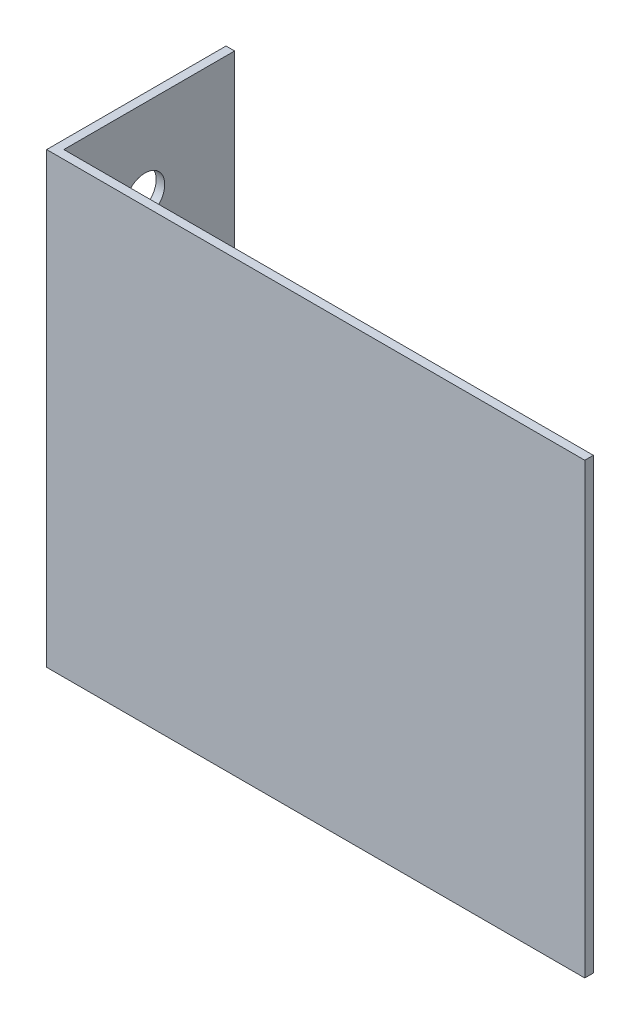
ISO-10303-21;
HEADER;
FILE_DESCRIPTION(('STEP AP214'),'2;1');
FILE_NAME('part.step','',(''),(''),'','','');
FILE_SCHEMA(('AUTOMOTIVE_DESIGN { 1 0 10303 214 1 1 1 1 }'));
ENDSEC;
DATA;
#1=APPLICATION_CONTEXT('core data for automotive mechanical design processes');
#2=APPLICATION_PROTOCOL_DEFINITION('international standard','automotive_design',2000,#1);
#3=PRODUCT_CONTEXT('',#1,'mechanical');
#4=PRODUCT('Part','Part','',(#3));
#5=PRODUCT_RELATED_PRODUCT_CATEGORY('part','',(#4));
#6=PRODUCT_DEFINITION_FORMATION('','',#4);
#7=PRODUCT_DEFINITION_CONTEXT('part definition',#1,'design');
#8=PRODUCT_DEFINITION('design','',#6,#7);
#9=PRODUCT_DEFINITION_SHAPE('','',#8);
#10=(LENGTH_UNIT() NAMED_UNIT(*) SI_UNIT(.MILLI.,.METRE.));
#11=(NAMED_UNIT(*) PLANE_ANGLE_UNIT() SI_UNIT($,.RADIAN.));
#12=(NAMED_UNIT(*) SI_UNIT($,.STERADIAN.) SOLID_ANGLE_UNIT());
#13=UNCERTAINTY_MEASURE_WITH_UNIT(LENGTH_MEASURE(1.E-05),#10,'distance_accuracy_value','');
#14=(GEOMETRIC_REPRESENTATION_CONTEXT(3) GLOBAL_UNCERTAINTY_ASSIGNED_CONTEXT((#13)) GLOBAL_UNIT_ASSIGNED_CONTEXT((#10,
#11,#12)) REPRESENTATION_CONTEXT('',''));
#15=CARTESIAN_POINT('',(0.,0.,0.));
#16=DIRECTION('',(0.,0.,1.));
#17=DIRECTION('',(1.,0.,0.));
#18=AXIS2_PLACEMENT_3D('',#15,#16,#17);
#19=CARTESIAN_POINT('',(76.2,63.5,0.));
#20=DIRECTION('',(0.,0.,-1.));
#21=DIRECTION('',(-1.,0.,0.));
#22=AXIS2_PLACEMENT_3D('',#19,#20,#21);
#23=PLANE('',#22);
#24=DIRECTION('',(1.,0.,0.));
#25=VECTOR('',#24,1.);
#26=CARTESIAN_POINT('',(76.2,0.,0.));
#27=LINE('',#26,#25);
#28=CARTESIAN_POINT('',(0.,0.,0.));
#29=VERTEX_POINT('',#28);
#30=CARTESIAN_POINT('',(76.2,0.,0.));
#31=VERTEX_POINT('',#30);
#32=EDGE_CURVE('E123',#29,#31,#27,.T.);
#33=ORIENTED_EDGE('',*,*,#32,.T.);
#34=DIRECTION('',(0.,-1.,0.));
#35=VECTOR('',#34,1.);
#36=CARTESIAN_POINT('',(76.2,63.5,0.));
#37=LINE('',#36,#35);
#38=CARTESIAN_POINT('',(76.2,63.5,0.));
#39=VERTEX_POINT('',#38);
#40=EDGE_CURVE('E11',#39,#31,#37,.T.);
#41=ORIENTED_EDGE('',*,*,#40,.F.);
#42=DIRECTION('',(1.,0.,0.));
#43=VECTOR('',#42,1.);
#44=CARTESIAN_POINT('',(76.2,63.5,0.));
#45=LINE('',#44,#43);
#46=CARTESIAN_POINT('',(0.,63.5,0.));
#47=VERTEX_POINT('',#46);
#48=EDGE_CURVE('E134',#47,#39,#45,.T.);
#49=ORIENTED_EDGE('',*,*,#48,.F.);
#50=DIRECTION('',(0.,-1.,0.));
#51=VECTOR('',#50,1.);
#52=CARTESIAN_POINT('',(0.,63.5,0.));
#53=LINE('',#52,#51);
#54=EDGE_CURVE('E119',#47,#29,#53,.T.);
#55=ORIENTED_EDGE('',*,*,#54,.T.);
#56=EDGE_LOOP('',(#33,#41,#49,#55));
#57=FACE_BOUND('',#56,.T.);
#58=ADVANCED_FACE('F39',(#57),#23,.F.);
#59=CARTESIAN_POINT('',(76.2,63.5,-1.21412));
#60=DIRECTION('',(-1.,0.,0.));
#61=DIRECTION('',(0.,0.,1.));
#62=AXIS2_PLACEMENT_3D('',#59,#60,#61);
#63=PLANE('',#62);
#64=DIRECTION('',(0.,0.,-1.));
#65=VECTOR('',#64,1.);
#66=CARTESIAN_POINT('',(76.2,0.,-1.21412));
#67=LINE('',#66,#65);
#68=CARTESIAN_POINT('',(76.2,0.,-1.21412));
#69=VERTEX_POINT('',#68);
#70=EDGE_CURVE('E126',#31,#69,#67,.T.);
#71=ORIENTED_EDGE('',*,*,#70,.T.);
#72=DIRECTION('',(0.,-1.,0.));
#73=VECTOR('',#72,1.);
#74=CARTESIAN_POINT('',(76.2,63.5,-1.21412));
#75=LINE('',#74,#73);
#76=CARTESIAN_POINT('',(76.2,63.5,-1.21412));
#77=VERTEX_POINT('',#76);
#78=EDGE_CURVE('E47',#77,#69,#75,.T.);
#79=ORIENTED_EDGE('',*,*,#78,.F.);
#80=DIRECTION('',(0.,0.,-1.));
#81=VECTOR('',#80,1.);
#82=CARTESIAN_POINT('',(76.2,63.5,-1.21412));
#83=LINE('',#82,#81);
#84=EDGE_CURVE('E92',#39,#77,#83,.T.);
#85=ORIENTED_EDGE('',*,*,#84,.F.);
#86=ORIENTED_EDGE('',*,*,#40,.T.);
#87=EDGE_LOOP('',(#71,#79,#85,#86));
#88=FACE_BOUND('',#87,.T.);
#89=ADVANCED_FACE('F161',(#88),#63,.F.);
#90=CARTESIAN_POINT('',(1.21412000000001,63.5,-1.21412));
#91=DIRECTION('',(0.,0.,1.));
#92=DIRECTION('',(1.,0.,0.));
#93=AXIS2_PLACEMENT_3D('',#90,#91,#92);
#94=PLANE('',#93);
#95=DIRECTION('',(-1.,0.,0.));
#96=VECTOR('',#95,1.);
#97=CARTESIAN_POINT('',(1.21412000000001,0.,-1.21412));
#98=LINE('',#97,#96);
#99=CARTESIAN_POINT('',(1.21412000000001,0.,-1.21412));
#100=VERTEX_POINT('',#99);
#101=EDGE_CURVE('E129',#69,#100,#98,.T.);
#102=ORIENTED_EDGE('',*,*,#101,.T.);
#103=DIRECTION('',(0.,-1.,0.));
#104=VECTOR('',#103,1.);
#105=CARTESIAN_POINT('',(1.21412000000001,63.5,-1.21412));
#106=LINE('',#105,#104);
#107=CARTESIAN_POINT('',(1.21412000000001,63.5,-1.21412));
#108=VERTEX_POINT('',#107);
#109=EDGE_CURVE('E114',#108,#100,#106,.T.);
#110=ORIENTED_EDGE('',*,*,#109,.F.);
#111=DIRECTION('',(-1.,0.,0.));
#112=VECTOR('',#111,1.);
#113=CARTESIAN_POINT('',(1.21412000000001,63.5,-1.21412));
#114=LINE('',#113,#112);
#115=EDGE_CURVE('E105',#77,#108,#114,.T.);
#116=ORIENTED_EDGE('',*,*,#115,.F.);
#117=ORIENTED_EDGE('',*,*,#78,.T.);
#118=EDGE_LOOP('',(#102,#110,#116,#117));
#119=FACE_BOUND('',#118,.T.);
#120=ADVANCED_FACE('F140',(#119),#94,.F.);
#121=CARTESIAN_POINT('',(1.21412,63.5,-25.4));
#122=DIRECTION('',(-1.,0.,0.));
#123=DIRECTION('',(0.,0.,1.));
#124=AXIS2_PLACEMENT_3D('',#121,#122,#123);
#125=PLANE('',#124);
#126=CARTESIAN_POINT('',(1.21412,11.43,-12.7));
#127=DIRECTION('',(-1.,0.,0.));
#128=DIRECTION('',(0.,0.,1.));
#129=AXIS2_PLACEMENT_3D('',#126,#127,#128);
#130=CIRCLE('',#129,2.8067);
#131=CARTESIAN_POINT('',(1.21412,11.43,-9.8933));
#132=VERTEX_POINT('',#131);
#133=EDGE_CURVE('E127',#132,#132,#130,.T.);
#134=ORIENTED_EDGE('',*,*,#133,.T.);
#135=EDGE_LOOP('',(#134));
#136=FACE_BOUND('',#135,.T.);
#137=CARTESIAN_POINT('',(1.21412,52.07,-12.7));
#138=DIRECTION('',(-1.,0.,0.));
#139=DIRECTION('',(0.,0.,1.));
#140=AXIS2_PLACEMENT_3D('',#137,#138,#139);
#141=CIRCLE('',#140,2.8067);
#142=CARTESIAN_POINT('',(1.21412,52.07,-9.8933));
#143=VERTEX_POINT('',#142);
#144=EDGE_CURVE('E179',#143,#143,#141,.T.);
#145=ORIENTED_EDGE('',*,*,#144,.T.);
#146=EDGE_LOOP('',(#145));
#147=FACE_BOUND('',#146,.T.);
#148=DIRECTION('',(0.,0.,-1.));
#149=VECTOR('',#148,1.);
#150=CARTESIAN_POINT('',(1.21412,0.,-25.4));
#151=LINE('',#150,#149);
#152=CARTESIAN_POINT('',(1.21412,0.,-25.4));
#153=VERTEX_POINT('',#152);
#154=EDGE_CURVE('E113',#100,#153,#151,.T.);
#155=ORIENTED_EDGE('',*,*,#154,.T.);
#156=DIRECTION('',(0.,-1.,0.));
#157=VECTOR('',#156,1.);
#158=CARTESIAN_POINT('',(1.21412,63.5,-25.4));
#159=LINE('',#158,#157);
#160=CARTESIAN_POINT('',(1.21412,63.5,-25.4));
#161=VERTEX_POINT('',#160);
#162=EDGE_CURVE('E110',#161,#153,#159,.T.);
#163=ORIENTED_EDGE('',*,*,#162,.F.);
#164=DIRECTION('',(0.,0.,-1.));
#165=VECTOR('',#164,1.);
#166=CARTESIAN_POINT('',(1.21412,63.5,-25.4));
#167=LINE('',#166,#165);
#168=EDGE_CURVE('E99',#108,#161,#167,.T.);
#169=ORIENTED_EDGE('',*,*,#168,.F.);
#170=ORIENTED_EDGE('',*,*,#109,.T.);
#171=EDGE_LOOP('',(#155,#163,#169,#170));
#172=FACE_BOUND('',#171,.T.);
#173=ADVANCED_FACE('F111',(#136,#147,#172),#125,.F.);
#174=CARTESIAN_POINT('',(0.,63.5,-25.4));
#175=DIRECTION('',(0.,0.,1.));
#176=DIRECTION('',(1.,0.,0.));
#177=AXIS2_PLACEMENT_3D('',#174,#175,#176);
#178=PLANE('',#177);
#179=DIRECTION('',(-1.,0.,0.));
#180=VECTOR('',#179,1.);
#181=CARTESIAN_POINT('',(0.,0.,-25.4));
#182=LINE('',#181,#180);
#183=CARTESIAN_POINT('',(0.,0.,-25.4));
#184=VERTEX_POINT('',#183);
#185=EDGE_CURVE('E78',#153,#184,#182,.T.);
#186=ORIENTED_EDGE('',*,*,#185,.T.);
#187=DIRECTION('',(0.,-1.,0.));
#188=VECTOR('',#187,1.);
#189=CARTESIAN_POINT('',(0.,63.5,-25.4));
#190=LINE('',#189,#188);
#191=CARTESIAN_POINT('',(0.,63.5,-25.4));
#192=VERTEX_POINT('',#191);
#193=EDGE_CURVE('E115',#192,#184,#190,.T.);
#194=ORIENTED_EDGE('',*,*,#193,.F.);
#195=DIRECTION('',(-1.,0.,0.));
#196=VECTOR('',#195,1.);
#197=CARTESIAN_POINT('',(0.,63.5,-25.4));
#198=LINE('',#197,#196);
#199=EDGE_CURVE('E103',#161,#192,#198,.T.);
#200=ORIENTED_EDGE('',*,*,#199,.F.);
#201=ORIENTED_EDGE('',*,*,#162,.T.);
#202=EDGE_LOOP('',(#186,#194,#200,#201));
#203=FACE_BOUND('',#202,.T.);
#204=ADVANCED_FACE('F117',(#203),#178,.F.);
#205=CARTESIAN_POINT('',(0.,63.5,0.));
#206=DIRECTION('',(1.,0.,0.));
#207=DIRECTION('',(0.,0.,-1.));
#208=AXIS2_PLACEMENT_3D('',#205,#206,#207);
#209=PLANE('',#208);
#210=CARTESIAN_POINT('',(0.,11.43,-12.7));
#211=DIRECTION('',(-1.,0.,0.));
#212=DIRECTION('',(0.,0.,1.));
#213=AXIS2_PLACEMENT_3D('',#210,#211,#212);
#214=CIRCLE('',#213,2.8067);
#215=CARTESIAN_POINT('',(0.,11.43,-9.8933));
#216=VERTEX_POINT('',#215);
#217=EDGE_CURVE('E181',#216,#216,#214,.T.);
#218=ORIENTED_EDGE('',*,*,#217,.F.);
#219=EDGE_LOOP('',(#218));
#220=FACE_BOUND('',#219,.T.);
#221=CARTESIAN_POINT('',(0.,52.07,-12.7));
#222=DIRECTION('',(-1.,0.,0.));
#223=DIRECTION('',(0.,0.,1.));
#224=AXIS2_PLACEMENT_3D('',#221,#222,#223);
#225=CIRCLE('',#224,2.8067);
#226=CARTESIAN_POINT('',(0.,52.07,-9.8933));
#227=VERTEX_POINT('',#226);
#228=EDGE_CURVE('E185',#227,#227,#225,.T.);
#229=ORIENTED_EDGE('',*,*,#228,.F.);
#230=EDGE_LOOP('',(#229));
#231=FACE_BOUND('',#230,.T.);
#232=DIRECTION('',(0.,0.,1.));
#233=VECTOR('',#232,1.);
#234=CARTESIAN_POINT('',(0.,0.,0.));
#235=LINE('',#234,#233);
#236=EDGE_CURVE('E84',#184,#29,#235,.T.);
#237=ORIENTED_EDGE('',*,*,#236,.T.);
#238=ORIENTED_EDGE('',*,*,#54,.F.);
#239=DIRECTION('',(0.,0.,1.));
#240=VECTOR('',#239,1.);
#241=CARTESIAN_POINT('',(0.,63.5,0.));
#242=LINE('',#241,#240);
#243=EDGE_CURVE('E55',#192,#47,#242,.T.);
#244=ORIENTED_EDGE('',*,*,#243,.F.);
#245=ORIENTED_EDGE('',*,*,#193,.T.);
#246=EDGE_LOOP('',(#237,#238,#244,#245));
#247=FACE_BOUND('',#246,.T.);
#248=ADVANCED_FACE('F147',(#220,#231,#247),#209,.F.);
#249=CARTESIAN_POINT('',(0.,63.5,0.));
#250=DIRECTION('',(0.,-1.,0.));
#251=DIRECTION('',(0.,0.,-1.));
#252=AXIS2_PLACEMENT_3D('',#249,#250,#251);
#253=PLANE('',#252);
#254=ORIENTED_EDGE('',*,*,#48,.T.);
#255=ORIENTED_EDGE('',*,*,#84,.T.);
#256=ORIENTED_EDGE('',*,*,#115,.T.);
#257=ORIENTED_EDGE('',*,*,#168,.T.);
#258=ORIENTED_EDGE('',*,*,#199,.T.);
#259=ORIENTED_EDGE('',*,*,#243,.T.);
#260=EDGE_LOOP('',(#254,#255,#256,#257,#258,#259));
#261=FACE_BOUND('',#260,.T.);
#262=ADVANCED_FACE('F101',(#261),#253,.F.);
#263=CARTESIAN_POINT('',(0.,0.,0.));
#264=DIRECTION('',(0.,-1.,0.));
#265=DIRECTION('',(0.,0.,-1.));
#266=AXIS2_PLACEMENT_3D('',#263,#264,#265);
#267=PLANE('',#266);
#268=ORIENTED_EDGE('',*,*,#32,.F.);
#269=ORIENTED_EDGE('',*,*,#236,.F.);
#270=ORIENTED_EDGE('',*,*,#185,.F.);
#271=ORIENTED_EDGE('',*,*,#154,.F.);
#272=ORIENTED_EDGE('',*,*,#101,.F.);
#273=ORIENTED_EDGE('',*,*,#70,.F.);
#274=EDGE_LOOP('',(#268,#269,#270,#271,#272,#273));
#275=FACE_BOUND('',#274,.T.);
#276=ADVANCED_FACE('F143',(#275),#267,.T.);
#277=CARTESIAN_POINT('',(2.54,52.07,-12.7));
#278=DIRECTION('',(-1.,0.,0.));
#279=DIRECTION('',(0.,0.,1.));
#280=AXIS2_PLACEMENT_3D('',#277,#278,#279);
#281=CYLINDRICAL_SURFACE('',#280,2.8067);
#282=ORIENTED_EDGE('',*,*,#228,.T.);
#283=EDGE_LOOP('',(#282));
#284=FACE_BOUND('',#283,.T.);
#285=ORIENTED_EDGE('',*,*,#144,.F.);
#286=EDGE_LOOP('',(#285));
#287=FACE_BOUND('',#286,.T.);
#288=ADVANCED_FACE('F193',(#284,#287),#281,.F.);
#289=CARTESIAN_POINT('',(2.54,11.43,-12.7));
#290=DIRECTION('',(-1.,0.,0.));
#291=DIRECTION('',(0.,0.,1.));
#292=AXIS2_PLACEMENT_3D('',#289,#290,#291);
#293=CYLINDRICAL_SURFACE('',#292,2.8067);
#294=ORIENTED_EDGE('',*,*,#217,.T.);
#295=EDGE_LOOP('',(#294));
#296=FACE_BOUND('',#295,.T.);
#297=ORIENTED_EDGE('',*,*,#133,.F.);
#298=EDGE_LOOP('',(#297));
#299=FACE_BOUND('',#298,.T.);
#300=ADVANCED_FACE('F195',(#296,#299),#293,.F.);
#301=CLOSED_SHELL('',(#58,#89,#120,#173,#204,#248,#262,#276,#288,#300));
#302=MANIFOLD_SOLID_BREP('B2',#301);
#303=ADVANCED_BREP_SHAPE_REPRESENTATION('',(#18,#302),#14);
#304=SHAPE_DEFINITION_REPRESENTATION(#9,#303);
ENDSEC;
END-ISO-10303-21;
